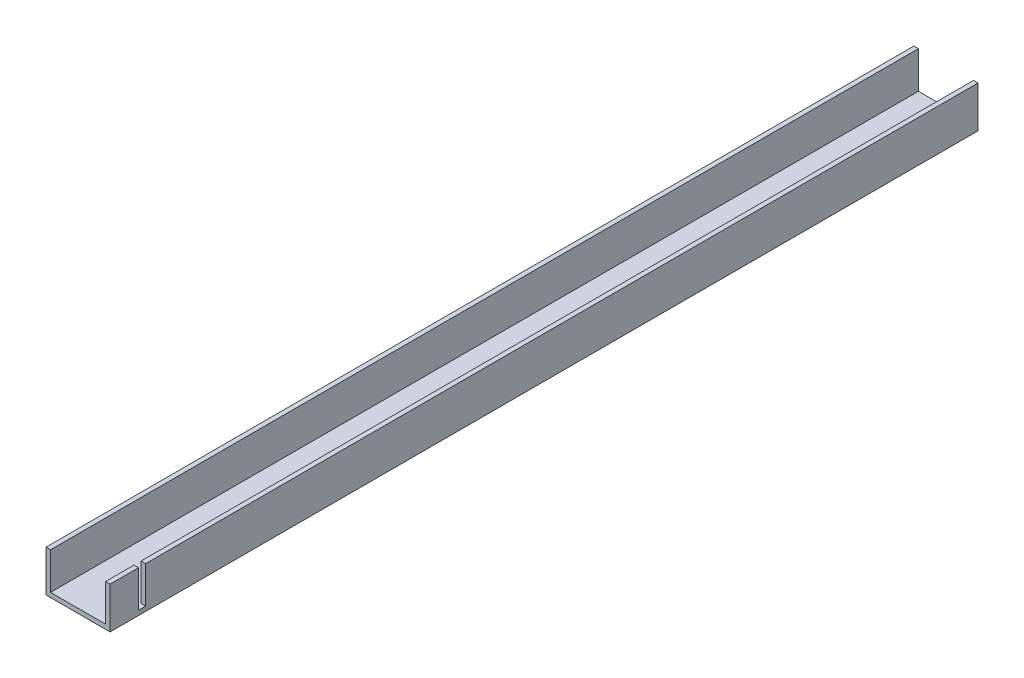
ISO-10303-21;
HEADER;
FILE_DESCRIPTION(('STEP AP214'),'2;1');
FILE_NAME('part.step','',(''),(''),'','','');
FILE_SCHEMA(('AUTOMOTIVE_DESIGN { 1 0 10303 214 1 1 1 1 }'));
ENDSEC;
DATA;
#1=APPLICATION_CONTEXT('core data for automotive mechanical design processes');
#2=APPLICATION_PROTOCOL_DEFINITION('international standard','automotive_design',2000,#1);
#3=PRODUCT_CONTEXT('',#1,'mechanical');
#4=PRODUCT('Part','Part','',(#3));
#5=PRODUCT_RELATED_PRODUCT_CATEGORY('part','',(#4));
#6=PRODUCT_DEFINITION_FORMATION('','',#4);
#7=PRODUCT_DEFINITION_CONTEXT('part definition',#1,'design');
#8=PRODUCT_DEFINITION('design','',#6,#7);
#9=PRODUCT_DEFINITION_SHAPE('','',#8);
#10=(LENGTH_UNIT() NAMED_UNIT(*) SI_UNIT(.MILLI.,.METRE.));
#11=(NAMED_UNIT(*) PLANE_ANGLE_UNIT() SI_UNIT($,.RADIAN.));
#12=(NAMED_UNIT(*) SI_UNIT($,.STERADIAN.) SOLID_ANGLE_UNIT());
#13=UNCERTAINTY_MEASURE_WITH_UNIT(LENGTH_MEASURE(1.E-05),#10,'distance_accuracy_value','');
#14=(GEOMETRIC_REPRESENTATION_CONTEXT(3) GLOBAL_UNCERTAINTY_ASSIGNED_CONTEXT((#13)) GLOBAL_UNIT_ASSIGNED_CONTEXT((#10,
#11,#12)) REPRESENTATION_CONTEXT('',''));
#15=CARTESIAN_POINT('',(0.,0.,0.));
#16=DIRECTION('',(0.,0.,1.));
#17=DIRECTION('',(1.,0.,0.));
#18=AXIS2_PLACEMENT_3D('',#15,#16,#17);
#19=CARTESIAN_POINT('',(22.5,0.,304.8));
#20=DIRECTION('',(0.,-1.,0.));
#21=DIRECTION('',(1.,0.,0.));
#22=AXIS2_PLACEMENT_3D('',#19,#20,#21);
#23=PLANE('',#22);
#24=DIRECTION('',(1.,0.,0.));
#25=VECTOR('',#24,1.);
#26=CARTESIAN_POINT('',(10.,0.,50.));
#27=LINE('',#26,#25);
#28=CARTESIAN_POINT('',(10.,0.,50.));
#29=VERTEX_POINT('',#28);
#30=CARTESIAN_POINT('',(12.5,0.,50.));
#31=VERTEX_POINT('',#30);
#32=EDGE_CURVE('E179',#29,#31,#27,.T.);
#33=ORIENTED_EDGE('',*,*,#32,.T.);
#34=DIRECTION('',(0.,0.,1.));
#35=VECTOR('',#34,1.);
#36=CARTESIAN_POINT('',(12.5,0.,0.));
#37=LINE('',#36,#35);
#38=CARTESIAN_POINT('',(12.5,0.,0.));
#39=VERTEX_POINT('',#38);
#40=EDGE_CURVE('E162',#39,#31,#37,.T.);
#41=ORIENTED_EDGE('',*,*,#40,.F.);
#42=DIRECTION('',(-1.,0.,0.));
#43=VECTOR('',#42,1.);
#44=CARTESIAN_POINT('',(22.5,0.,0.));
#45=LINE('',#44,#43);
#46=CARTESIAN_POINT('',(22.5,0.,0.));
#47=VERTEX_POINT('',#46);
#48=EDGE_CURVE('E176',#47,#39,#45,.T.);
#49=ORIENTED_EDGE('',*,*,#48,.F.);
#50=DIRECTION('',(0.,0.,-1.));
#51=VECTOR('',#50,1.);
#52=CARTESIAN_POINT('',(22.5,0.,304.8));
#53=LINE('',#52,#51);
#54=CARTESIAN_POINT('',(22.5,0.,304.8));
#55=VERTEX_POINT('',#54);
#56=EDGE_CURVE('E11',#55,#47,#53,.T.);
#57=ORIENTED_EDGE('',*,*,#56,.F.);
#58=DIRECTION('',(-1.,0.,0.));
#59=VECTOR('',#58,1.);
#60=CARTESIAN_POINT('',(22.5,0.,304.8));
#61=LINE('',#60,#59);
#62=CARTESIAN_POINT('',(0.,0.,304.8));
#63=VERTEX_POINT('',#62);
#64=EDGE_CURVE('E221',#55,#63,#61,.T.);
#65=ORIENTED_EDGE('',*,*,#64,.T.);
#66=DIRECTION('',(0.,0.,-1.));
#67=VECTOR('',#66,1.);
#68=CARTESIAN_POINT('',(0.,0.,304.8));
#69=LINE('',#68,#67);
#70=CARTESIAN_POINT('',(0.,0.,0.));
#71=VERTEX_POINT('',#70);
#72=EDGE_CURVE('E49',#63,#71,#69,.T.);
#73=ORIENTED_EDGE('',*,*,#72,.T.);
#74=CARTESIAN_POINT('',(10.,0.,0.));
#75=VERTEX_POINT('',#74);
#76=EDGE_CURVE('E189',#75,#71,#45,.T.);
#77=ORIENTED_EDGE('',*,*,#76,.F.);
#78=DIRECTION('',(0.,0.,1.));
#79=VECTOR('',#78,1.);
#80=CARTESIAN_POINT('',(10.,0.,0.));
#81=LINE('',#80,#79);
#82=EDGE_CURVE('E63',#75,#29,#81,.T.);
#83=ORIENTED_EDGE('',*,*,#82,.T.);
#84=EDGE_LOOP('',(#33,#41,#49,#57,#65,#73,#77,#83));
#85=FACE_BOUND('',#84,.T.);
#86=ADVANCED_FACE('F46',(#85),#23,.T.);
#87=CARTESIAN_POINT('',(1.5875,1.5875,304.8));
#88=DIRECTION('',(0.,1.,0.));
#89=DIRECTION('',(-1.,0.,0.));
#90=AXIS2_PLACEMENT_3D('',#87,#88,#89);
#91=PLANE('',#90);
#92=DIRECTION('',(1.,0.,0.));
#93=VECTOR('',#92,1.);
#94=CARTESIAN_POINT('',(1.5875,1.5875,0.));
#95=LINE('',#94,#93);
#96=CARTESIAN_POINT('',(12.5,1.5875,0.));
#97=VERTEX_POINT('',#96);
#98=CARTESIAN_POINT('',(20.9125,1.5875,0.));
#99=VERTEX_POINT('',#98);
#100=EDGE_CURVE('E208',#97,#99,#95,.T.);
#101=ORIENTED_EDGE('',*,*,#100,.F.);
#102=DIRECTION('',(0.,0.,1.));
#103=VECTOR('',#102,1.);
#104=CARTESIAN_POINT('',(12.5,1.5875,0.));
#105=LINE('',#104,#103);
#106=CARTESIAN_POINT('',(12.5,1.5875,50.));
#107=VERTEX_POINT('',#106);
#108=EDGE_CURVE('E165',#97,#107,#105,.T.);
#109=ORIENTED_EDGE('',*,*,#108,.T.);
#110=DIRECTION('',(1.,0.,0.));
#111=VECTOR('',#110,1.);
#112=CARTESIAN_POINT('',(10.,1.5875,50.));
#113=LINE('',#112,#111);
#114=CARTESIAN_POINT('',(10.,1.5875,50.));
#115=VERTEX_POINT('',#114);
#116=EDGE_CURVE('E322',#115,#107,#113,.T.);
#117=ORIENTED_EDGE('',*,*,#116,.F.);
#118=DIRECTION('',(0.,0.,1.));
#119=VECTOR('',#118,1.);
#120=CARTESIAN_POINT('',(10.,1.5875,0.));
#121=LINE('',#120,#119);
#122=CARTESIAN_POINT('',(10.,1.5875,0.));
#123=VERTEX_POINT('',#122);
#124=EDGE_CURVE('E181',#123,#115,#121,.T.);
#125=ORIENTED_EDGE('',*,*,#124,.F.);
#126=CARTESIAN_POINT('',(1.5875,1.5875,0.));
#127=VERTEX_POINT('',#126);
#128=EDGE_CURVE('E209',#127,#123,#95,.T.);
#129=ORIENTED_EDGE('',*,*,#128,.F.);
#130=DIRECTION('',(0.,0.,-1.));
#131=VECTOR('',#130,1.);
#132=CARTESIAN_POINT('',(1.5875,1.5875,304.8));
#133=LINE('',#132,#131);
#134=CARTESIAN_POINT('',(1.5875,1.5875,304.8));
#135=VERTEX_POINT('',#134);
#136=EDGE_CURVE('E237',#135,#127,#133,.T.);
#137=ORIENTED_EDGE('',*,*,#136,.F.);
#138=DIRECTION('',(1.,0.,0.));
#139=VECTOR('',#138,1.);
#140=CARTESIAN_POINT('',(1.5875,1.5875,304.8));
#141=LINE('',#140,#139);
#142=CARTESIAN_POINT('',(20.9125,1.5875,304.8));
#143=VERTEX_POINT('',#142);
#144=EDGE_CURVE('E264',#135,#143,#141,.T.);
#145=ORIENTED_EDGE('',*,*,#144,.T.);
#146=DIRECTION('',(0.,0.,-1.));
#147=VECTOR('',#146,1.);
#148=CARTESIAN_POINT('',(20.9125,1.5875,304.8));
#149=LINE('',#148,#147);
#150=CARTESIAN_POINT('',(20.9125,1.5875,294.8));
#151=VERTEX_POINT('',#150);
#152=EDGE_CURVE('E232',#143,#151,#149,.T.);
#153=ORIENTED_EDGE('',*,*,#152,.T.);
#154=DIRECTION('',(-1.,0.,0.));
#155=VECTOR('',#154,1.);
#156=CARTESIAN_POINT('',(22.5,1.5875,294.8));
#157=LINE('',#156,#155);
#158=CARTESIAN_POINT('',(22.5,1.5875,294.8));
#159=VERTEX_POINT('',#158);
#160=EDGE_CURVE('E286',#159,#151,#157,.T.);
#161=ORIENTED_EDGE('',*,*,#160,.F.);
#162=DIRECTION('',(0.,0.,1.));
#163=VECTOR('',#162,1.);
#164=CARTESIAN_POINT('',(22.5,1.5875,292.3));
#165=LINE('',#164,#163);
#166=CARTESIAN_POINT('',(22.5,1.5875,292.3));
#167=VERTEX_POINT('',#166);
#168=EDGE_CURVE('E305',#167,#159,#165,.T.);
#169=ORIENTED_EDGE('',*,*,#168,.F.);
#170=DIRECTION('',(-1.,0.,0.));
#171=VECTOR('',#170,1.);
#172=CARTESIAN_POINT('',(22.5,1.5875,292.3));
#173=LINE('',#172,#171);
#174=CARTESIAN_POINT('',(20.9125,1.5875,292.3));
#175=VERTEX_POINT('',#174);
#176=EDGE_CURVE('E289',#167,#175,#173,.T.);
#177=ORIENTED_EDGE('',*,*,#176,.T.);
#178=EDGE_CURVE('E236',#175,#99,#149,.T.);
#179=ORIENTED_EDGE('',*,*,#178,.T.);
#180=EDGE_LOOP('',(#101,#109,#117,#125,#129,#137,#145,#153,#161,#169,#177,#179));
#181=FACE_BOUND('',#180,.T.);
#182=ADVANCED_FACE('F338',(#181),#91,.T.);
#183=CARTESIAN_POINT('',(0.,0.,0.));
#184=DIRECTION('',(0.,0.,-1.));
#185=DIRECTION('',(-1.,0.,0.));
#186=AXIS2_PLACEMENT_3D('',#183,#184,#185);
#187=PLANE('',#186);
#188=ORIENTED_EDGE('',*,*,#48,.T.);
#189=DIRECTION('',(0.,1.,0.));
#190=VECTOR('',#189,1.);
#191=CARTESIAN_POINT('',(12.5,0.,0.));
#192=LINE('',#191,#190);
#193=EDGE_CURVE('E159',#39,#97,#192,.T.);
#194=ORIENTED_EDGE('',*,*,#193,.T.);
#195=ORIENTED_EDGE('',*,*,#100,.T.);
#196=DIRECTION('',(0.,1.,0.));
#197=VECTOR('',#196,1.);
#198=CARTESIAN_POINT('',(20.9125,1.5875,0.));
#199=LINE('',#198,#197);
#200=CARTESIAN_POINT('',(20.9125,14.55,0.));
#201=VERTEX_POINT('',#200);
#202=EDGE_CURVE('E213',#99,#201,#199,.T.);
#203=ORIENTED_EDGE('',*,*,#202,.T.);
#204=DIRECTION('',(1.,0.,0.));
#205=VECTOR('',#204,1.);
#206=CARTESIAN_POINT('',(20.9125,14.55,0.));
#207=LINE('',#206,#205);
#208=CARTESIAN_POINT('',(22.5,14.55,0.));
#209=VERTEX_POINT('',#208);
#210=EDGE_CURVE('E217',#201,#209,#207,.T.);
#211=ORIENTED_EDGE('',*,*,#210,.T.);
#212=DIRECTION('',(0.,-1.,0.));
#213=VECTOR('',#212,1.);
#214=CARTESIAN_POINT('',(22.5,14.55,0.));
#215=LINE('',#214,#213);
#216=EDGE_CURVE('E186',#209,#47,#215,.T.);
#217=ORIENTED_EDGE('',*,*,#216,.T.);
#218=EDGE_LOOP('',(#188,#194,#195,#203,#211,#217));
#219=FACE_BOUND('',#218,.T.);
#220=ADVANCED_FACE('F183',(#219),#187,.T.);
#221=CARTESIAN_POINT('',(22.5,14.55,304.8));
#222=DIRECTION('',(1.,0.,0.));
#223=DIRECTION('',(0.,1.,0.));
#224=AXIS2_PLACEMENT_3D('',#221,#222,#223);
#225=PLANE('',#224);
#226=ORIENTED_EDGE('',*,*,#168,.T.);
#227=DIRECTION('',(0.,-1.,0.));
#228=VECTOR('',#227,1.);
#229=CARTESIAN_POINT('',(22.5,14.55,294.8));
#230=LINE('',#229,#228);
#231=CARTESIAN_POINT('',(22.5,14.55,294.8));
#232=VERTEX_POINT('',#231);
#233=EDGE_CURVE('E298',#232,#159,#230,.T.);
#234=ORIENTED_EDGE('',*,*,#233,.F.);
#235=DIRECTION('',(0.,0.,-1.));
#236=VECTOR('',#235,1.);
#237=CARTESIAN_POINT('',(22.5,14.55,304.8));
#238=LINE('',#237,#236);
#239=CARTESIAN_POINT('',(22.5,14.55,304.8));
#240=VERTEX_POINT('',#239);
#241=EDGE_CURVE('E55',#240,#232,#238,.T.);
#242=ORIENTED_EDGE('',*,*,#241,.F.);
#243=DIRECTION('',(0.,-1.,0.));
#244=VECTOR('',#243,1.);
#245=CARTESIAN_POINT('',(22.5,14.55,304.8));
#246=LINE('',#245,#244);
#247=EDGE_CURVE('E198',#240,#55,#246,.T.);
#248=ORIENTED_EDGE('',*,*,#247,.T.);
#249=ORIENTED_EDGE('',*,*,#56,.T.);
#250=ORIENTED_EDGE('',*,*,#216,.F.);
#251=CARTESIAN_POINT('',(22.5,14.55,292.3));
#252=VERTEX_POINT('',#251);
#253=EDGE_CURVE('E226',#252,#209,#238,.T.);
#254=ORIENTED_EDGE('',*,*,#253,.F.);
#255=DIRECTION('',(0.,-1.,0.));
#256=VECTOR('',#255,1.);
#257=CARTESIAN_POINT('',(22.5,14.55,292.3));
#258=LINE('',#257,#256);
#259=EDGE_CURVE('E295',#252,#167,#258,.T.);
#260=ORIENTED_EDGE('',*,*,#259,.T.);
#261=EDGE_LOOP('',(#226,#234,#242,#248,#249,#250,#254,#260));
#262=FACE_BOUND('',#261,.T.);
#263=ADVANCED_FACE('F359',(#262),#225,.T.);
#264=CARTESIAN_POINT('',(20.9125,14.55,304.8));
#265=DIRECTION('',(0.,1.,0.));
#266=DIRECTION('',(0.,0.,1.));
#267=AXIS2_PLACEMENT_3D('',#264,#265,#266);
#268=PLANE('',#267);
#269=ORIENTED_EDGE('',*,*,#241,.T.);
#270=DIRECTION('',(-1.,0.,0.));
#271=VECTOR('',#270,1.);
#272=CARTESIAN_POINT('',(22.5,14.55,294.8));
#273=LINE('',#272,#271);
#274=CARTESIAN_POINT('',(20.9125,14.55,294.8));
#275=VERTEX_POINT('',#274);
#276=EDGE_CURVE('E196',#232,#275,#273,.T.);
#277=ORIENTED_EDGE('',*,*,#276,.T.);
#278=DIRECTION('',(0.,0.,-1.));
#279=VECTOR('',#278,1.);
#280=CARTESIAN_POINT('',(20.9125,14.55,304.8));
#281=LINE('',#280,#279);
#282=CARTESIAN_POINT('',(20.9125,14.55,304.8));
#283=VERTEX_POINT('',#282);
#284=EDGE_CURVE('E227',#283,#275,#281,.T.);
#285=ORIENTED_EDGE('',*,*,#284,.F.);
#286=DIRECTION('',(1.,0.,0.));
#287=VECTOR('',#286,1.);
#288=CARTESIAN_POINT('',(20.9125,14.55,304.8));
#289=LINE('',#288,#287);
#290=EDGE_CURVE('E254',#283,#240,#289,.T.);
#291=ORIENTED_EDGE('',*,*,#290,.T.);
#292=EDGE_LOOP('',(#269,#277,#285,#291));
#293=FACE_BOUND('',#292,.T.);
#294=ADVANCED_FACE('F402',(#293),#268,.T.);
#295=CARTESIAN_POINT('',(20.9125,1.5875,304.8));
#296=DIRECTION('',(-1.,0.,0.));
#297=DIRECTION('',(0.,0.,1.));
#298=AXIS2_PLACEMENT_3D('',#295,#296,#297);
#299=PLANE('',#298);
#300=ORIENTED_EDGE('',*,*,#284,.T.);
#301=DIRECTION('',(0.,-1.,0.));
#302=VECTOR('',#301,1.);
#303=CARTESIAN_POINT('',(20.9125,14.55,294.8));
#304=LINE('',#303,#302);
#305=EDGE_CURVE('E170',#275,#151,#304,.T.);
#306=ORIENTED_EDGE('',*,*,#305,.T.);
#307=ORIENTED_EDGE('',*,*,#152,.F.);
#308=DIRECTION('',(0.,1.,0.));
#309=VECTOR('',#308,1.);
#310=CARTESIAN_POINT('',(20.9125,1.5875,304.8));
#311=LINE('',#310,#309);
#312=EDGE_CURVE('E259',#143,#283,#311,.T.);
#313=ORIENTED_EDGE('',*,*,#312,.T.);
#314=EDGE_LOOP('',(#300,#306,#307,#313));
#315=FACE_BOUND('',#314,.T.);
#316=ADVANCED_FACE('F404',(#315),#299,.T.);
#317=DIRECTION('',(-1.,0.,0.));
#318=VECTOR('',#317,1.);
#319=CARTESIAN_POINT('',(22.5,14.55,292.3));
#320=LINE('',#319,#318);
#321=CARTESIAN_POINT('',(20.9125,14.55,292.3));
#322=VERTEX_POINT('',#321);
#323=EDGE_CURVE('E292',#252,#322,#320,.T.);
#324=ORIENTED_EDGE('',*,*,#323,.F.);
#325=ORIENTED_EDGE('',*,*,#253,.T.);
#326=ORIENTED_EDGE('',*,*,#210,.F.);
#327=EDGE_CURVE('E231',#322,#201,#281,.T.);
#328=ORIENTED_EDGE('',*,*,#327,.F.);
#329=EDGE_LOOP('',(#324,#325,#326,#328));
#330=FACE_BOUND('',#329,.T.);
#331=ADVANCED_FACE('F398',(#330),#268,.T.);
#332=DIRECTION('',(0.,-1.,0.));
#333=VECTOR('',#332,1.);
#334=CARTESIAN_POINT('',(20.9125,14.55,292.3));
#335=LINE('',#334,#333);
#336=EDGE_CURVE('E71',#322,#175,#335,.T.);
#337=ORIENTED_EDGE('',*,*,#336,.F.);
#338=ORIENTED_EDGE('',*,*,#327,.T.);
#339=ORIENTED_EDGE('',*,*,#202,.F.);
#340=ORIENTED_EDGE('',*,*,#178,.F.);
#341=EDGE_LOOP('',(#337,#338,#339,#340));
#342=FACE_BOUND('',#341,.T.);
#343=ADVANCED_FACE('F363',(#342),#299,.T.);
#344=CARTESIAN_POINT('',(1.5875,14.55,304.8));
#345=DIRECTION('',(1.,0.,0.));
#346=DIRECTION('',(0.,1.,0.));
#347=AXIS2_PLACEMENT_3D('',#344,#345,#346);
#348=PLANE('',#347);
#349=DIRECTION('',(0.,-1.,0.));
#350=VECTOR('',#349,1.);
#351=CARTESIAN_POINT('',(1.5875,14.55,0.));
#352=LINE('',#351,#350);
#353=CARTESIAN_POINT('',(1.5875,14.55,0.));
#354=VERTEX_POINT('',#353);
#355=EDGE_CURVE('E204',#354,#127,#352,.T.);
#356=ORIENTED_EDGE('',*,*,#355,.F.);
#357=DIRECTION('',(0.,0.,-1.));
#358=VECTOR('',#357,1.);
#359=CARTESIAN_POINT('',(1.5875,14.55,304.8));
#360=LINE('',#359,#358);
#361=CARTESIAN_POINT('',(1.5875,14.55,304.8));
#362=VERTEX_POINT('',#361);
#363=EDGE_CURVE('E240',#362,#354,#360,.T.);
#364=ORIENTED_EDGE('',*,*,#363,.F.);
#365=DIRECTION('',(0.,-1.,0.));
#366=VECTOR('',#365,1.);
#367=CARTESIAN_POINT('',(1.5875,14.55,304.8));
#368=LINE('',#367,#366);
#369=EDGE_CURVE('E270',#362,#135,#368,.T.);
#370=ORIENTED_EDGE('',*,*,#369,.T.);
#371=ORIENTED_EDGE('',*,*,#136,.T.);
#372=EDGE_LOOP('',(#356,#364,#370,#371));
#373=FACE_BOUND('',#372,.T.);
#374=ADVANCED_FACE('F365',(#373),#348,.T.);
#375=CARTESIAN_POINT('',(0.,14.55,304.8));
#376=DIRECTION('',(0.,1.,0.));
#377=DIRECTION('',(-1.,0.,0.));
#378=AXIS2_PLACEMENT_3D('',#375,#376,#377);
#379=PLANE('',#378);
#380=DIRECTION('',(1.,0.,0.));
#381=VECTOR('',#380,1.);
#382=CARTESIAN_POINT('',(0.,14.55,0.));
#383=LINE('',#382,#381);
#384=CARTESIAN_POINT('',(0.,14.55,0.));
#385=VERTEX_POINT('',#384);
#386=EDGE_CURVE('E194',#385,#354,#383,.T.);
#387=ORIENTED_EDGE('',*,*,#386,.F.);
#388=DIRECTION('',(0.,0.,-1.));
#389=VECTOR('',#388,1.);
#390=CARTESIAN_POINT('',(0.,14.55,304.8));
#391=LINE('',#390,#389);
#392=CARTESIAN_POINT('',(0.,14.55,304.8));
#393=VERTEX_POINT('',#392);
#394=EDGE_CURVE('E242',#393,#385,#391,.T.);
#395=ORIENTED_EDGE('',*,*,#394,.F.);
#396=DIRECTION('',(1.,0.,0.));
#397=VECTOR('',#396,1.);
#398=CARTESIAN_POINT('',(0.,14.55,304.8));
#399=LINE('',#398,#397);
#400=EDGE_CURVE('E274',#393,#362,#399,.T.);
#401=ORIENTED_EDGE('',*,*,#400,.T.);
#402=ORIENTED_EDGE('',*,*,#363,.T.);
#403=EDGE_LOOP('',(#387,#395,#401,#402));
#404=FACE_BOUND('',#403,.T.);
#405=ADVANCED_FACE('F368',(#404),#379,.T.);
#406=CARTESIAN_POINT('',(0.,0.,304.8));
#407=DIRECTION('',(-1.,0.,0.));
#408=DIRECTION('',(0.,0.,1.));
#409=AXIS2_PLACEMENT_3D('',#406,#407,#408);
#410=PLANE('',#409);
#411=DIRECTION('',(0.,1.,0.));
#412=VECTOR('',#411,1.);
#413=CARTESIAN_POINT('',(0.,0.,0.));
#414=LINE('',#413,#412);
#415=EDGE_CURVE('E188',#71,#385,#414,.T.);
#416=ORIENTED_EDGE('',*,*,#415,.F.);
#417=ORIENTED_EDGE('',*,*,#72,.F.);
#418=DIRECTION('',(0.,1.,0.));
#419=VECTOR('',#418,1.);
#420=CARTESIAN_POINT('',(0.,0.,304.8));
#421=LINE('',#420,#419);
#422=EDGE_CURVE('E278',#63,#393,#421,.T.);
#423=ORIENTED_EDGE('',*,*,#422,.T.);
#424=ORIENTED_EDGE('',*,*,#394,.T.);
#425=EDGE_LOOP('',(#416,#417,#423,#424));
#426=FACE_BOUND('',#425,.T.);
#427=ADVANCED_FACE('F371',(#426),#410,.T.);
#428=CARTESIAN_POINT('',(0.,0.,304.8));
#429=DIRECTION('',(0.,0.,-1.));
#430=DIRECTION('',(-1.,0.,0.));
#431=AXIS2_PLACEMENT_3D('',#428,#429,#430);
#432=PLANE('',#431);
#433=ORIENTED_EDGE('',*,*,#64,.F.);
#434=ORIENTED_EDGE('',*,*,#247,.F.);
#435=ORIENTED_EDGE('',*,*,#290,.F.);
#436=ORIENTED_EDGE('',*,*,#312,.F.);
#437=ORIENTED_EDGE('',*,*,#144,.F.);
#438=ORIENTED_EDGE('',*,*,#369,.F.);
#439=ORIENTED_EDGE('',*,*,#400,.F.);
#440=ORIENTED_EDGE('',*,*,#422,.F.);
#441=EDGE_LOOP('',(#433,#434,#435,#436,#437,#438,#439,#440));
#442=FACE_BOUND('',#441,.T.);
#443=ADVANCED_FACE('F374',(#442),#432,.F.);
#444=DIRECTION('',(0.,1.,0.));
#445=VECTOR('',#444,1.);
#446=CARTESIAN_POINT('',(10.,0.,0.));
#447=LINE('',#446,#445);
#448=EDGE_CURVE('E316',#75,#123,#447,.T.);
#449=ORIENTED_EDGE('',*,*,#448,.F.);
#450=ORIENTED_EDGE('',*,*,#76,.T.);
#451=ORIENTED_EDGE('',*,*,#415,.T.);
#452=ORIENTED_EDGE('',*,*,#386,.T.);
#453=ORIENTED_EDGE('',*,*,#355,.T.);
#454=ORIENTED_EDGE('',*,*,#128,.T.);
#455=EDGE_LOOP('',(#449,#450,#451,#452,#453,#454));
#456=FACE_BOUND('',#455,.T.);
#457=ADVANCED_FACE('F332',(#456),#187,.T.);
#458=CARTESIAN_POINT('',(22.5,14.55,294.8));
#459=DIRECTION('',(0.,0.,-1.));
#460=DIRECTION('',(-1.,0.,0.));
#461=AXIS2_PLACEMENT_3D('',#458,#459,#460);
#462=PLANE('',#461);
#463=ORIENTED_EDGE('',*,*,#305,.F.);
#464=ORIENTED_EDGE('',*,*,#276,.F.);
#465=ORIENTED_EDGE('',*,*,#233,.T.);
#466=ORIENTED_EDGE('',*,*,#160,.T.);
#467=EDGE_LOOP('',(#463,#464,#465,#466));
#468=FACE_BOUND('',#467,.T.);
#469=ADVANCED_FACE('F408',(#468),#462,.T.);
#470=CARTESIAN_POINT('',(22.5,14.55,292.3));
#471=DIRECTION('',(0.,0.,-1.));
#472=DIRECTION('',(-1.,0.,0.));
#473=AXIS2_PLACEMENT_3D('',#470,#471,#472);
#474=PLANE('',#473);
#475=ORIENTED_EDGE('',*,*,#336,.T.);
#476=ORIENTED_EDGE('',*,*,#176,.F.);
#477=ORIENTED_EDGE('',*,*,#259,.F.);
#478=ORIENTED_EDGE('',*,*,#323,.T.);
#479=EDGE_LOOP('',(#475,#476,#477,#478));
#480=FACE_BOUND('',#479,.T.);
#481=ADVANCED_FACE('F348',(#480),#474,.F.);
#482=CARTESIAN_POINT('',(12.5,0.,0.));
#483=DIRECTION('',(-1.,0.,0.));
#484=DIRECTION('',(0.,0.,1.));
#485=AXIS2_PLACEMENT_3D('',#482,#483,#484);
#486=PLANE('',#485);
#487=ORIENTED_EDGE('',*,*,#108,.F.);
#488=ORIENTED_EDGE('',*,*,#193,.F.);
#489=ORIENTED_EDGE('',*,*,#40,.T.);
#490=DIRECTION('',(0.,1.,0.));
#491=VECTOR('',#490,1.);
#492=CARTESIAN_POINT('',(12.5,0.,50.));
#493=LINE('',#492,#491);
#494=EDGE_CURVE('E171',#31,#107,#493,.T.);
#495=ORIENTED_EDGE('',*,*,#494,.T.);
#496=EDGE_LOOP('',(#487,#488,#489,#495));
#497=FACE_BOUND('',#496,.T.);
#498=ADVANCED_FACE('F161',(#497),#486,.T.);
#499=CARTESIAN_POINT('',(10.,0.,50.));
#500=DIRECTION('',(0.,0.,1.));
#501=DIRECTION('',(1.,0.,0.));
#502=AXIS2_PLACEMENT_3D('',#499,#500,#501);
#503=PLANE('',#502);
#504=ORIENTED_EDGE('',*,*,#116,.T.);
#505=ORIENTED_EDGE('',*,*,#494,.F.);
#506=ORIENTED_EDGE('',*,*,#32,.F.);
#507=DIRECTION('',(0.,1.,0.));
#508=VECTOR('',#507,1.);
#509=CARTESIAN_POINT('',(10.,0.,50.));
#510=LINE('',#509,#508);
#511=EDGE_CURVE('E313',#29,#115,#510,.T.);
#512=ORIENTED_EDGE('',*,*,#511,.T.);
#513=EDGE_LOOP('',(#504,#505,#506,#512));
#514=FACE_BOUND('',#513,.T.);
#515=ADVANCED_FACE('F340',(#514),#503,.F.);
#516=CARTESIAN_POINT('',(10.,0.,0.));
#517=DIRECTION('',(-1.,0.,0.));
#518=DIRECTION('',(0.,0.,1.));
#519=AXIS2_PLACEMENT_3D('',#516,#517,#518);
#520=PLANE('',#519);
#521=ORIENTED_EDGE('',*,*,#124,.T.);
#522=ORIENTED_EDGE('',*,*,#511,.F.);
#523=ORIENTED_EDGE('',*,*,#82,.F.);
#524=ORIENTED_EDGE('',*,*,#448,.T.);
#525=EDGE_LOOP('',(#521,#522,#523,#524));
#526=FACE_BOUND('',#525,.T.);
#527=ADVANCED_FACE('F335',(#526),#520,.F.);
#528=CLOSED_SHELL('',(#86,#182,#220,#263,#294,#316,#331,#343,#374,#405,#427,#443,#457,#469,#481,
#498,#515,#527));
#529=MANIFOLD_SOLID_BREP('B2',#528);
#530=ADVANCED_BREP_SHAPE_REPRESENTATION('',(#18,#529),#14);
#531=SHAPE_DEFINITION_REPRESENTATION(#9,#530);
ENDSEC;
END-ISO-10303-21;
